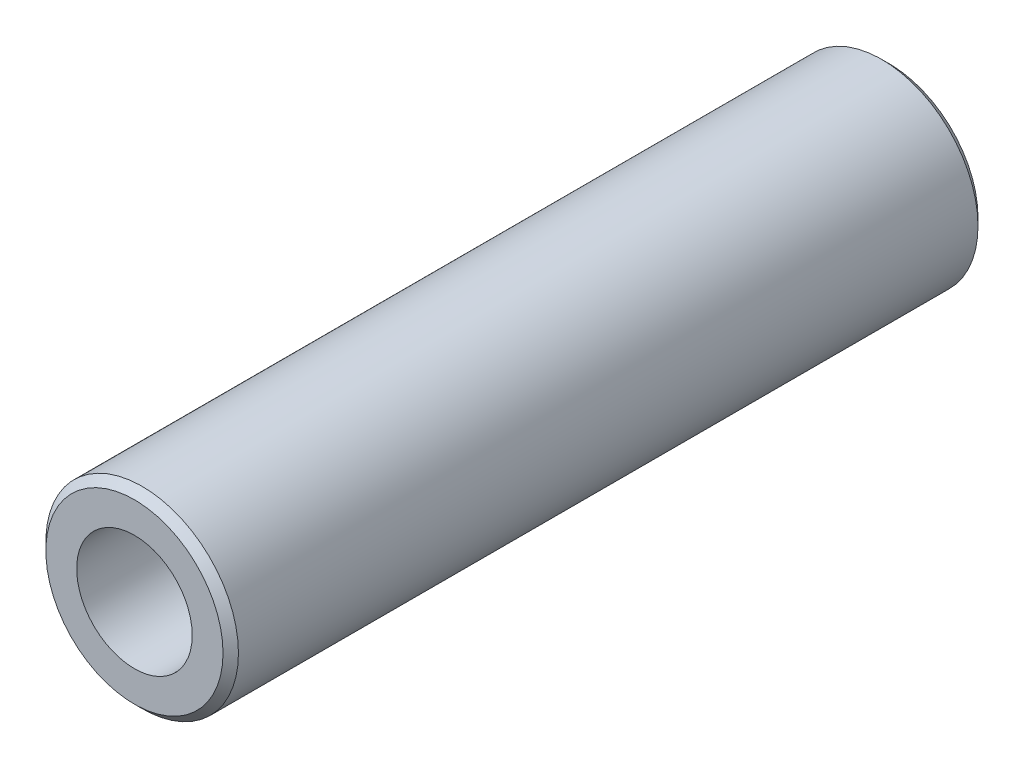
ISO-10303-21;
HEADER;
FILE_DESCRIPTION(('STEP AP214'),'2;1');
FILE_NAME('part.step','',(''),(''),'','','');
FILE_SCHEMA(('AUTOMOTIVE_DESIGN { 1 0 10303 214 1 1 1 1 }'));
ENDSEC;
DATA;
#1=APPLICATION_CONTEXT('core data for automotive mechanical design processes');
#2=APPLICATION_PROTOCOL_DEFINITION('international standard','automotive_design',2000,#1);
#3=PRODUCT_CONTEXT('',#1,'mechanical');
#4=PRODUCT('Part','Part','',(#3));
#5=PRODUCT_RELATED_PRODUCT_CATEGORY('part','',(#4));
#6=PRODUCT_DEFINITION_FORMATION('','',#4);
#7=PRODUCT_DEFINITION_CONTEXT('part definition',#1,'design');
#8=PRODUCT_DEFINITION('design','',#6,#7);
#9=PRODUCT_DEFINITION_SHAPE('','',#8);
#10=(LENGTH_UNIT() NAMED_UNIT(*) SI_UNIT(.MILLI.,.METRE.));
#11=(NAMED_UNIT(*) PLANE_ANGLE_UNIT() SI_UNIT($,.RADIAN.));
#12=(NAMED_UNIT(*) SI_UNIT($,.STERADIAN.) SOLID_ANGLE_UNIT());
#13=UNCERTAINTY_MEASURE_WITH_UNIT(LENGTH_MEASURE(1.E-05),#10,'distance_accuracy_value','');
#14=(GEOMETRIC_REPRESENTATION_CONTEXT(3) GLOBAL_UNCERTAINTY_ASSIGNED_CONTEXT((#13)) GLOBAL_UNIT_ASSIGNED_CONTEXT((#10,
#11,#12)) REPRESENTATION_CONTEXT('',''));
#15=CARTESIAN_POINT('',(0.,0.,0.));
#16=DIRECTION('',(0.,0.,1.));
#17=DIRECTION('',(1.,0.,0.));
#18=AXIS2_PLACEMENT_3D('',#15,#16,#17);
#19=CARTESIAN_POINT('',(0.,0.,24.5));
#20=DIRECTION('',(0.,0.,1.));
#21=DIRECTION('',(1.,0.,0.));
#22=AXIS2_PLACEMENT_3D('',#19,#20,#21);
#23=PLANE('',#22);
#24=CARTESIAN_POINT('',(0.,0.,24.5));
#25=DIRECTION('',(0.,0.,1.));
#26=DIRECTION('',(1.,0.,0.));
#27=AXIS2_PLACEMENT_3D('',#24,#25,#26);
#28=CIRCLE('',#27,5.75);
#29=CARTESIAN_POINT('',(5.75,0.,24.5));
#30=VERTEX_POINT('',#29);
#31=EDGE_CURVE('E11',#30,#30,#28,.T.);
#32=ORIENTED_EDGE('',*,*,#31,.T.);
#33=EDGE_LOOP('',(#32));
#34=FACE_BOUND('',#33,.T.);
#35=CARTESIAN_POINT('',(0.,0.,24.5));
#36=DIRECTION('',(0.,0.,1.));
#37=DIRECTION('',(1.,0.,0.));
#38=AXIS2_PLACEMENT_3D('',#35,#36,#37);
#39=CIRCLE('',#38,3.75);
#40=CARTESIAN_POINT('',(3.75,0.,24.5));
#41=VERTEX_POINT('',#40);
#42=EDGE_CURVE('E57',#41,#41,#39,.T.);
#43=ORIENTED_EDGE('',*,*,#42,.F.);
#44=EDGE_LOOP('',(#43));
#45=FACE_BOUND('',#44,.T.);
#46=ADVANCED_FACE('F37',(#34,#45),#23,.T.);
#47=CARTESIAN_POINT('',(0.,0.,-24.5));
#48=DIRECTION('',(0.,0.,1.));
#49=DIRECTION('',(1.,0.,0.));
#50=AXIS2_PLACEMENT_3D('',#47,#48,#49);
#51=PLANE('',#50);
#52=CARTESIAN_POINT('',(0.,0.,-24.5));
#53=DIRECTION('',(0.,0.,1.));
#54=DIRECTION('',(1.,0.,0.));
#55=AXIS2_PLACEMENT_3D('',#52,#53,#54);
#56=CIRCLE('',#55,5.74999999999998);
#57=CARTESIAN_POINT('',(5.74999999999998,0.,-24.5));
#58=VERTEX_POINT('',#57);
#59=EDGE_CURVE('E44',#58,#58,#56,.F.);
#60=ORIENTED_EDGE('',*,*,#59,.T.);
#61=EDGE_LOOP('',(#60));
#62=FACE_BOUND('',#61,.T.);
#63=CARTESIAN_POINT('',(0.,0.,-24.5));
#64=DIRECTION('',(0.,0.,1.));
#65=DIRECTION('',(1.,0.,0.));
#66=AXIS2_PLACEMENT_3D('',#63,#64,#65);
#67=CIRCLE('',#66,3.75);
#68=CARTESIAN_POINT('',(3.75,0.,-24.5));
#69=VERTEX_POINT('',#68);
#70=EDGE_CURVE('E58',#69,#69,#67,.T.);
#71=ORIENTED_EDGE('',*,*,#70,.T.);
#72=EDGE_LOOP('',(#71));
#73=FACE_BOUND('',#72,.T.);
#74=ADVANCED_FACE('F68',(#62,#73),#51,.F.);
#75=CARTESIAN_POINT('',(0.,0.,24.5));
#76=DIRECTION('',(0.,0.,-1.));
#77=DIRECTION('',(-1.,0.,0.));
#78=AXIS2_PLACEMENT_3D('',#75,#76,#77);
#79=CYLINDRICAL_SURFACE('',#78,6.25);
#80=CARTESIAN_POINT('',(0.,0.,-24.));
#81=DIRECTION('',(0.,0.,1.));
#82=DIRECTION('',(1.,0.,0.));
#83=AXIS2_PLACEMENT_3D('',#80,#81,#82);
#84=CIRCLE('',#83,6.25);
#85=CARTESIAN_POINT('',(6.25,0.,-24.));
#86=VERTEX_POINT('',#85);
#87=EDGE_CURVE('E48',#86,#86,#84,.T.);
#88=ORIENTED_EDGE('',*,*,#87,.T.);
#89=EDGE_LOOP('',(#88));
#90=FACE_BOUND('',#89,.T.);
#91=CARTESIAN_POINT('',(0.,0.,24.));
#92=DIRECTION('',(0.,0.,1.));
#93=DIRECTION('',(1.,0.,0.));
#94=AXIS2_PLACEMENT_3D('',#91,#92,#93);
#95=CIRCLE('',#94,6.25);
#96=CARTESIAN_POINT('',(6.25,0.,24.));
#97=VERTEX_POINT('',#96);
#98=EDGE_CURVE('E52',#97,#97,#95,.F.);
#99=ORIENTED_EDGE('',*,*,#98,.T.);
#100=EDGE_LOOP('',(#99));
#101=FACE_BOUND('',#100,.T.);
#102=ADVANCED_FACE('F73',(#90,#101),#79,.T.);
#103=CARTESIAN_POINT('',(0.,0.,24.5));
#104=DIRECTION('',(0.,0.,-1.));
#105=DIRECTION('',(-1.,0.,0.));
#106=AXIS2_PLACEMENT_3D('',#103,#104,#105);
#107=CYLINDRICAL_SURFACE('',#106,3.75);
#108=ORIENTED_EDGE('',*,*,#42,.T.);
#109=EDGE_LOOP('',(#108));
#110=FACE_BOUND('',#109,.T.);
#111=ORIENTED_EDGE('',*,*,#70,.F.);
#112=EDGE_LOOP('',(#111));
#113=FACE_BOUND('',#112,.T.);
#114=ADVANCED_FACE('F64',(#110,#113),#107,.F.);
#115=CARTESIAN_POINT('',(0.,0.,-24.));
#116=DIRECTION('',(0.,0.,1.));
#117=DIRECTION('',(1.,0.,0.));
#118=AXIS2_PLACEMENT_3D('',#115,#116,#117);
#119=CONICAL_SURFACE('',#118,6.25,0.785398163397454);
#120=ORIENTED_EDGE('',*,*,#59,.F.);
#121=EDGE_LOOP('',(#120));
#122=FACE_BOUND('',#121,.T.);
#123=ORIENTED_EDGE('',*,*,#87,.F.);
#124=EDGE_LOOP('',(#123));
#125=FACE_BOUND('',#124,.T.);
#126=ADVANCED_FACE('F79',(#122,#125),#119,.T.);
#127=CARTESIAN_POINT('',(0.,0.,24.5));
#128=DIRECTION('',(0.,0.,-1.));
#129=DIRECTION('',(-1.,0.,0.));
#130=AXIS2_PLACEMENT_3D('',#127,#128,#129);
#131=CONICAL_SURFACE('',#130,5.75,0.785398163397447);
#132=ORIENTED_EDGE('',*,*,#98,.F.);
#133=EDGE_LOOP('',(#132));
#134=FACE_BOUND('',#133,.T.);
#135=ORIENTED_EDGE('',*,*,#31,.F.);
#136=EDGE_LOOP('',(#135));
#137=FACE_BOUND('',#136,.T.);
#138=ADVANCED_FACE('F39',(#134,#137),#131,.T.);
#139=CLOSED_SHELL('',(#46,#74,#102,#114,#126,#138));
#140=MANIFOLD_SOLID_BREP('B2',#139);
#141=ADVANCED_BREP_SHAPE_REPRESENTATION('',(#18,#140),#14);
#142=SHAPE_DEFINITION_REPRESENTATION(#9,#141);
ENDSEC;
END-ISO-10303-21;
